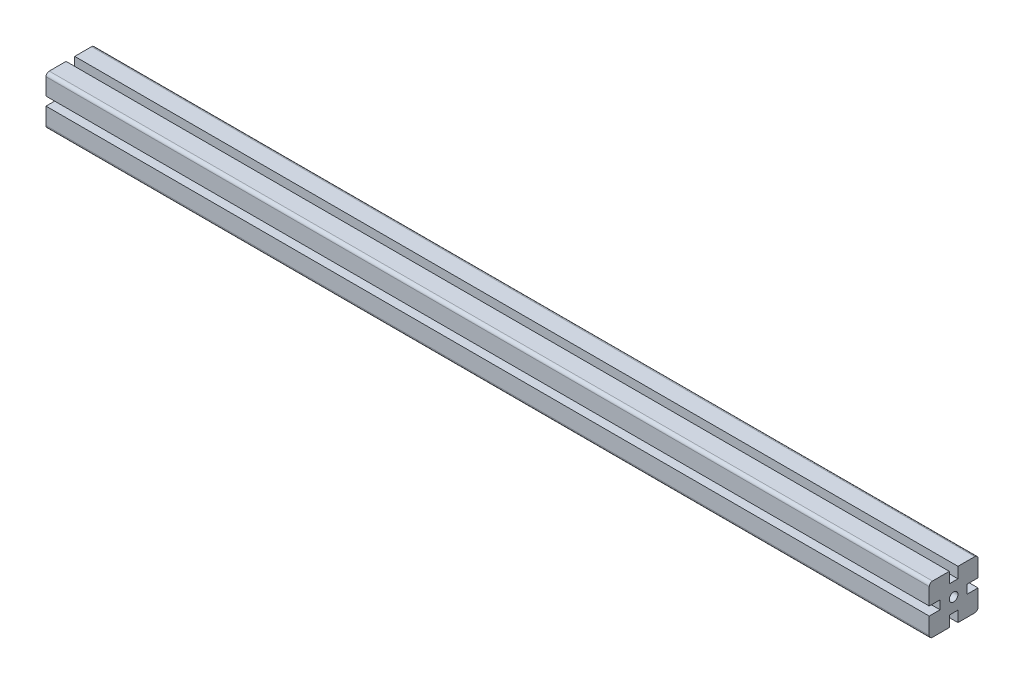
ISO-10303-21;
HEADER;
FILE_DESCRIPTION(('STEP AP214'),'2;1');
FILE_NAME('part.step','',(''),(''),'','','');
FILE_SCHEMA(('AUTOMOTIVE_DESIGN { 1 0 10303 214 1 1 1 1 }'));
ENDSEC;
DATA;
#1=APPLICATION_CONTEXT('core data for automotive mechanical design processes');
#2=APPLICATION_PROTOCOL_DEFINITION('international standard','automotive_design',2000,#1);
#3=PRODUCT_CONTEXT('',#1,'mechanical');
#4=PRODUCT('Part','Part','',(#3));
#5=PRODUCT_RELATED_PRODUCT_CATEGORY('part','',(#4));
#6=PRODUCT_DEFINITION_FORMATION('','',#4);
#7=PRODUCT_DEFINITION_CONTEXT('part definition',#1,'design');
#8=PRODUCT_DEFINITION('design','',#6,#7);
#9=PRODUCT_DEFINITION_SHAPE('','',#8);
#10=(LENGTH_UNIT() NAMED_UNIT(*) SI_UNIT(.MILLI.,.METRE.));
#11=(NAMED_UNIT(*) PLANE_ANGLE_UNIT() SI_UNIT($,.RADIAN.));
#12=(NAMED_UNIT(*) SI_UNIT($,.STERADIAN.) SOLID_ANGLE_UNIT());
#13=UNCERTAINTY_MEASURE_WITH_UNIT(LENGTH_MEASURE(1.E-05),#10,'distance_accuracy_value','');
#14=(GEOMETRIC_REPRESENTATION_CONTEXT(3) GLOBAL_UNCERTAINTY_ASSIGNED_CONTEXT((#13)) GLOBAL_UNIT_ASSIGNED_CONTEXT((#10,
#11,#12)) REPRESENTATION_CONTEXT('',''));
#15=CARTESIAN_POINT('',(0.,0.,0.));
#16=DIRECTION('',(0.,0.,1.));
#17=DIRECTION('',(1.,0.,0.));
#18=AXIS2_PLACEMENT_3D('',#15,#16,#17);
#19=CARTESIAN_POINT('',(185.,-22.5,-22.5));
#20=DIRECTION('',(0.,0.,-1.));
#21=DIRECTION('',(0.,1.,0.));
#22=AXIS2_PLACEMENT_3D('',#19,#20,#21);
#23=PLANE('',#22);
#24=DIRECTION('',(0.,1.,0.));
#25=VECTOR('',#24,1.);
#26=CARTESIAN_POINT('',(1000.,-22.5,-22.5));
#27=LINE('',#26,#25);
#28=CARTESIAN_POINT('',(1000.,-19.5,-22.5));
#29=VERTEX_POINT('',#28);
#30=CARTESIAN_POINT('',(1000.,-4.,-22.5));
#31=VERTEX_POINT('',#30);
#32=EDGE_CURVE('E271',#29,#31,#27,.T.);
#33=ORIENTED_EDGE('',*,*,#32,.F.);
#34=DIRECTION('',(1.,0.,0.));
#35=VECTOR('',#34,1.);
#36=CARTESIAN_POINT('',(185.,-19.5,-22.5));
#37=LINE('',#36,#35);
#38=CARTESIAN_POINT('',(185.,-19.5,-22.5));
#39=VERTEX_POINT('',#38);
#40=EDGE_CURVE('E202',#29,#39,#37,.F.);
#41=ORIENTED_EDGE('',*,*,#40,.T.);
#42=DIRECTION('',(0.,1.,0.));
#43=VECTOR('',#42,1.);
#44=CARTESIAN_POINT('',(185.,-22.5,-22.5));
#45=LINE('',#44,#43);
#46=CARTESIAN_POINT('',(185.,-4.,-22.5));
#47=VERTEX_POINT('',#46);
#48=EDGE_CURVE('E196',#39,#47,#45,.T.);
#49=ORIENTED_EDGE('',*,*,#48,.T.);
#50=DIRECTION('',(1.,0.,0.));
#51=VECTOR('',#50,1.);
#52=CARTESIAN_POINT('',(185.,-4.,-22.5));
#53=LINE('',#52,#51);
#54=EDGE_CURVE('E199',#47,#31,#53,.T.);
#55=ORIENTED_EDGE('',*,*,#54,.T.);
#56=EDGE_LOOP('',(#33,#41,#49,#55));
#57=FACE_BOUND('',#56,.T.);
#58=ADVANCED_FACE('F34',(#57),#23,.T.);
#59=CARTESIAN_POINT('',(185.,-22.5,-4.));
#60=DIRECTION('',(0.,-1.,0.));
#61=DIRECTION('',(0.,0.,-1.));
#62=AXIS2_PLACEMENT_3D('',#59,#60,#61);
#63=PLANE('',#62);
#64=DIRECTION('',(0.,0.,-1.));
#65=VECTOR('',#64,1.);
#66=CARTESIAN_POINT('',(185.,-22.5,-4.));
#67=LINE('',#66,#65);
#68=CARTESIAN_POINT('',(185.,-22.5,-4.));
#69=VERTEX_POINT('',#68);
#70=CARTESIAN_POINT('',(185.,-22.5,-19.5));
#71=VERTEX_POINT('',#70);
#72=EDGE_CURVE('E214',#69,#71,#67,.T.);
#73=ORIENTED_EDGE('',*,*,#72,.T.);
#74=DIRECTION('',(1.,0.,0.));
#75=VECTOR('',#74,1.);
#76=CARTESIAN_POINT('',(185.,-22.5,-19.5));
#77=LINE('',#76,#75);
#78=CARTESIAN_POINT('',(1000.,-22.5,-19.5));
#79=VERTEX_POINT('',#78);
#80=EDGE_CURVE('E327',#71,#79,#77,.T.);
#81=ORIENTED_EDGE('',*,*,#80,.T.);
#82=DIRECTION('',(0.,0.,-1.));
#83=VECTOR('',#82,1.);
#84=CARTESIAN_POINT('',(1000.,-22.5,-4.));
#85=LINE('',#84,#83);
#86=CARTESIAN_POINT('',(1000.,-22.5,-4.));
#87=VERTEX_POINT('',#86);
#88=EDGE_CURVE('E206',#87,#79,#85,.T.);
#89=ORIENTED_EDGE('',*,*,#88,.F.);
#90=DIRECTION('',(1.,0.,0.));
#91=VECTOR('',#90,1.);
#92=CARTESIAN_POINT('',(185.,-22.5,-4.));
#93=LINE('',#92,#91);
#94=EDGE_CURVE('E325',#69,#87,#93,.T.);
#95=ORIENTED_EDGE('',*,*,#94,.F.);
#96=EDGE_LOOP('',(#73,#81,#89,#95));
#97=FACE_BOUND('',#96,.T.);
#98=ADVANCED_FACE('F447',(#97),#63,.T.);
#99=CARTESIAN_POINT('',(185.,-12.5,-4.));
#100=DIRECTION('',(0.,0.,1.));
#101=DIRECTION('',(1.,0.,0.));
#102=AXIS2_PLACEMENT_3D('',#99,#100,#101);
#103=PLANE('',#102);
#104=DIRECTION('',(0.,-1.,0.));
#105=VECTOR('',#104,1.);
#106=CARTESIAN_POINT('',(1000.,-12.5,-4.));
#107=LINE('',#106,#105);
#108=CARTESIAN_POINT('',(1000.,-12.5,-4.));
#109=VERTEX_POINT('',#108);
#110=EDGE_CURVE('E320',#109,#87,#107,.T.);
#111=ORIENTED_EDGE('',*,*,#110,.F.);
#112=DIRECTION('',(1.,0.,0.));
#113=VECTOR('',#112,1.);
#114=CARTESIAN_POINT('',(185.,-12.5,-4.));
#115=LINE('',#114,#113);
#116=CARTESIAN_POINT('',(185.,-12.5,-4.));
#117=VERTEX_POINT('',#116);
#118=EDGE_CURVE('E328',#117,#109,#115,.T.);
#119=ORIENTED_EDGE('',*,*,#118,.F.);
#120=DIRECTION('',(0.,-1.,0.));
#121=VECTOR('',#120,1.);
#122=CARTESIAN_POINT('',(185.,-12.5,-4.));
#123=LINE('',#122,#121);
#124=EDGE_CURVE('E266',#117,#69,#123,.T.);
#125=ORIENTED_EDGE('',*,*,#124,.T.);
#126=ORIENTED_EDGE('',*,*,#94,.T.);
#127=EDGE_LOOP('',(#111,#119,#125,#126));
#128=FACE_BOUND('',#127,.T.);
#129=ADVANCED_FACE('F444',(#128),#103,.T.);
#130=CARTESIAN_POINT('',(185.,-12.5,4.));
#131=DIRECTION('',(0.,-1.,0.));
#132=DIRECTION('',(0.,0.,-1.));
#133=AXIS2_PLACEMENT_3D('',#130,#131,#132);
#134=PLANE('',#133);
#135=DIRECTION('',(0.,0.,-1.));
#136=VECTOR('',#135,1.);
#137=CARTESIAN_POINT('',(1000.,-12.5,4.));
#138=LINE('',#137,#136);
#139=CARTESIAN_POINT('',(1000.,-12.5,4.));
#140=VERTEX_POINT('',#139);
#141=EDGE_CURVE('E317',#140,#109,#138,.T.);
#142=ORIENTED_EDGE('',*,*,#141,.F.);
#143=DIRECTION('',(1.,0.,0.));
#144=VECTOR('',#143,1.);
#145=CARTESIAN_POINT('',(185.,-12.5,4.));
#146=LINE('',#145,#144);
#147=CARTESIAN_POINT('',(185.,-12.5,4.));
#148=VERTEX_POINT('',#147);
#149=EDGE_CURVE('E330',#148,#140,#146,.T.);
#150=ORIENTED_EDGE('',*,*,#149,.F.);
#151=DIRECTION('',(0.,0.,-1.));
#152=VECTOR('',#151,1.);
#153=CARTESIAN_POINT('',(185.,-12.5,4.));
#154=LINE('',#153,#152);
#155=EDGE_CURVE('E263',#148,#117,#154,.T.);
#156=ORIENTED_EDGE('',*,*,#155,.T.);
#157=ORIENTED_EDGE('',*,*,#118,.T.);
#158=EDGE_LOOP('',(#142,#150,#156,#157));
#159=FACE_BOUND('',#158,.T.);
#160=ADVANCED_FACE('F442',(#159),#134,.T.);
#161=CARTESIAN_POINT('',(185.,-22.5,4.));
#162=DIRECTION('',(0.,0.,-1.));
#163=DIRECTION('',(-1.,0.,0.));
#164=AXIS2_PLACEMENT_3D('',#161,#162,#163);
#165=PLANE('',#164);
#166=DIRECTION('',(0.,1.,0.));
#167=VECTOR('',#166,1.);
#168=CARTESIAN_POINT('',(1000.,-22.5,4.));
#169=LINE('',#168,#167);
#170=CARTESIAN_POINT('',(1000.,-22.5,4.));
#171=VERTEX_POINT('',#170);
#172=EDGE_CURVE('E314',#171,#140,#169,.T.);
#173=ORIENTED_EDGE('',*,*,#172,.F.);
#174=DIRECTION('',(1.,0.,0.));
#175=VECTOR('',#174,1.);
#176=CARTESIAN_POINT('',(185.,-22.5,4.));
#177=LINE('',#176,#175);
#178=CARTESIAN_POINT('',(185.,-22.5,4.));
#179=VERTEX_POINT('',#178);
#180=EDGE_CURVE('E332',#179,#171,#177,.T.);
#181=ORIENTED_EDGE('',*,*,#180,.F.);
#182=DIRECTION('',(0.,1.,0.));
#183=VECTOR('',#182,1.);
#184=CARTESIAN_POINT('',(185.,-22.5,4.));
#185=LINE('',#184,#183);
#186=EDGE_CURVE('E260',#179,#148,#185,.T.);
#187=ORIENTED_EDGE('',*,*,#186,.T.);
#188=ORIENTED_EDGE('',*,*,#149,.T.);
#189=EDGE_LOOP('',(#173,#181,#187,#188));
#190=FACE_BOUND('',#189,.T.);
#191=ADVANCED_FACE('F437',(#190),#165,.T.);
#192=CARTESIAN_POINT('',(185.,-22.5,22.5));
#193=DIRECTION('',(0.,-1.,0.));
#194=DIRECTION('',(0.,0.,-1.));
#195=AXIS2_PLACEMENT_3D('',#192,#193,#194);
#196=PLANE('',#195);
#197=DIRECTION('',(0.,0.,-1.));
#198=VECTOR('',#197,1.);
#199=CARTESIAN_POINT('',(1000.,-22.5,22.5));
#200=LINE('',#199,#198);
#201=CARTESIAN_POINT('',(1000.,-22.5,19.5));
#202=VERTEX_POINT('',#201);
#203=EDGE_CURVE('E312',#202,#171,#200,.T.);
#204=ORIENTED_EDGE('',*,*,#203,.F.);
#205=DIRECTION('',(1.,0.,0.));
#206=VECTOR('',#205,1.);
#207=CARTESIAN_POINT('',(185.,-22.5,19.5));
#208=LINE('',#207,#206);
#209=CARTESIAN_POINT('',(185.,-22.5,19.5));
#210=VERTEX_POINT('',#209);
#211=EDGE_CURVE('E383',#202,#210,#208,.F.);
#212=ORIENTED_EDGE('',*,*,#211,.T.);
#213=DIRECTION('',(0.,0.,-1.));
#214=VECTOR('',#213,1.);
#215=CARTESIAN_POINT('',(185.,-22.5,22.5));
#216=LINE('',#215,#214);
#217=EDGE_CURVE('E258',#210,#179,#216,.T.);
#218=ORIENTED_EDGE('',*,*,#217,.T.);
#219=ORIENTED_EDGE('',*,*,#180,.T.);
#220=EDGE_LOOP('',(#204,#212,#218,#219));
#221=FACE_BOUND('',#220,.T.);
#222=ADVANCED_FACE('F430',(#221),#196,.T.);
#223=CARTESIAN_POINT('',(185.,-4.,22.5));
#224=DIRECTION('',(0.,0.,1.));
#225=DIRECTION('',(0.,-1.,0.));
#226=AXIS2_PLACEMENT_3D('',#223,#224,#225);
#227=PLANE('',#226);
#228=DIRECTION('',(0.,-1.,0.));
#229=VECTOR('',#228,1.);
#230=CARTESIAN_POINT('',(185.,-4.,22.5));
#231=LINE('',#230,#229);
#232=CARTESIAN_POINT('',(185.,-4.,22.5));
#233=VERTEX_POINT('',#232);
#234=CARTESIAN_POINT('',(185.,-19.5,22.5));
#235=VERTEX_POINT('',#234);
#236=EDGE_CURVE('E255',#233,#235,#231,.T.);
#237=ORIENTED_EDGE('',*,*,#236,.T.);
#238=DIRECTION('',(1.,0.,0.));
#239=VECTOR('',#238,1.);
#240=CARTESIAN_POINT('',(185.,-19.5,22.5));
#241=LINE('',#240,#239);
#242=CARTESIAN_POINT('',(1000.,-19.5,22.5));
#243=VERTEX_POINT('',#242);
#244=EDGE_CURVE('E380',#235,#243,#241,.T.);
#245=ORIENTED_EDGE('',*,*,#244,.T.);
#246=DIRECTION('',(0.,-1.,0.));
#247=VECTOR('',#246,1.);
#248=CARTESIAN_POINT('',(1000.,-4.,22.5));
#249=LINE('',#248,#247);
#250=CARTESIAN_POINT('',(1000.,-4.,22.5));
#251=VERTEX_POINT('',#250);
#252=EDGE_CURVE('E309',#251,#243,#249,.T.);
#253=ORIENTED_EDGE('',*,*,#252,.F.);
#254=DIRECTION('',(1.,0.,0.));
#255=VECTOR('',#254,1.);
#256=CARTESIAN_POINT('',(185.,-4.,22.5));
#257=LINE('',#256,#255);
#258=EDGE_CURVE('E335',#233,#251,#257,.T.);
#259=ORIENTED_EDGE('',*,*,#258,.F.);
#260=EDGE_LOOP('',(#237,#245,#253,#259));
#261=FACE_BOUND('',#260,.T.);
#262=ADVANCED_FACE('F421',(#261),#227,.T.);
#263=CARTESIAN_POINT('',(185.,-4.,12.5));
#264=DIRECTION('',(0.,1.,0.));
#265=DIRECTION('',(0.,0.,1.));
#266=AXIS2_PLACEMENT_3D('',#263,#264,#265);
#267=PLANE('',#266);
#268=DIRECTION('',(0.,0.,1.));
#269=VECTOR('',#268,1.);
#270=CARTESIAN_POINT('',(1000.,-4.,12.5));
#271=LINE('',#270,#269);
#272=CARTESIAN_POINT('',(1000.,-4.,12.5));
#273=VERTEX_POINT('',#272);
#274=EDGE_CURVE('E306',#273,#251,#271,.T.);
#275=ORIENTED_EDGE('',*,*,#274,.F.);
#276=DIRECTION('',(1.,0.,0.));
#277=VECTOR('',#276,1.);
#278=CARTESIAN_POINT('',(185.,-4.,12.5));
#279=LINE('',#278,#277);
#280=CARTESIAN_POINT('',(185.,-4.,12.5));
#281=VERTEX_POINT('',#280);
#282=EDGE_CURVE('E337',#281,#273,#279,.T.);
#283=ORIENTED_EDGE('',*,*,#282,.F.);
#284=DIRECTION('',(0.,0.,1.));
#285=VECTOR('',#284,1.);
#286=CARTESIAN_POINT('',(185.,-4.,12.5));
#287=LINE('',#286,#285);
#288=EDGE_CURVE('E252',#281,#233,#287,.T.);
#289=ORIENTED_EDGE('',*,*,#288,.T.);
#290=ORIENTED_EDGE('',*,*,#258,.T.);
#291=EDGE_LOOP('',(#275,#283,#289,#290));
#292=FACE_BOUND('',#291,.T.);
#293=ADVANCED_FACE('F417',(#292),#267,.T.);
#294=CARTESIAN_POINT('',(185.,4.,12.5));
#295=DIRECTION('',(0.,0.,1.));
#296=DIRECTION('',(1.,0.,0.));
#297=AXIS2_PLACEMENT_3D('',#294,#295,#296);
#298=PLANE('',#297);
#299=DIRECTION('',(0.,-1.,0.));
#300=VECTOR('',#299,1.);
#301=CARTESIAN_POINT('',(1000.,4.,12.5));
#302=LINE('',#301,#300);
#303=CARTESIAN_POINT('',(1000.,4.,12.5));
#304=VERTEX_POINT('',#303);
#305=EDGE_CURVE('E303',#304,#273,#302,.T.);
#306=ORIENTED_EDGE('',*,*,#305,.F.);
#307=DIRECTION('',(1.,0.,0.));
#308=VECTOR('',#307,1.);
#309=CARTESIAN_POINT('',(185.,4.,12.5));
#310=LINE('',#309,#308);
#311=CARTESIAN_POINT('',(185.,4.,12.5));
#312=VERTEX_POINT('',#311);
#313=EDGE_CURVE('E339',#312,#304,#310,.T.);
#314=ORIENTED_EDGE('',*,*,#313,.F.);
#315=DIRECTION('',(0.,-1.,0.));
#316=VECTOR('',#315,1.);
#317=CARTESIAN_POINT('',(185.,4.,12.5));
#318=LINE('',#317,#316);
#319=EDGE_CURVE('E249',#312,#281,#318,.T.);
#320=ORIENTED_EDGE('',*,*,#319,.T.);
#321=ORIENTED_EDGE('',*,*,#282,.T.);
#322=EDGE_LOOP('',(#306,#314,#320,#321));
#323=FACE_BOUND('',#322,.T.);
#324=ADVANCED_FACE('F413',(#323),#298,.T.);
#325=CARTESIAN_POINT('',(185.,4.,22.5));
#326=DIRECTION('',(0.,-1.,0.));
#327=DIRECTION('',(0.,0.,-1.));
#328=AXIS2_PLACEMENT_3D('',#325,#326,#327);
#329=PLANE('',#328);
#330=DIRECTION('',(0.,0.,-1.));
#331=VECTOR('',#330,1.);
#332=CARTESIAN_POINT('',(1000.,4.,22.5));
#333=LINE('',#332,#331);
#334=CARTESIAN_POINT('',(1000.,4.,22.5));
#335=VERTEX_POINT('',#334);
#336=EDGE_CURVE('E300',#335,#304,#333,.T.);
#337=ORIENTED_EDGE('',*,*,#336,.F.);
#338=DIRECTION('',(1.,0.,0.));
#339=VECTOR('',#338,1.);
#340=CARTESIAN_POINT('',(185.,4.,22.5));
#341=LINE('',#340,#339);
#342=CARTESIAN_POINT('',(185.,4.,22.5));
#343=VERTEX_POINT('',#342);
#344=EDGE_CURVE('E341',#343,#335,#341,.T.);
#345=ORIENTED_EDGE('',*,*,#344,.F.);
#346=DIRECTION('',(0.,0.,-1.));
#347=VECTOR('',#346,1.);
#348=CARTESIAN_POINT('',(185.,4.,22.5));
#349=LINE('',#348,#347);
#350=EDGE_CURVE('E246',#343,#312,#349,.T.);
#351=ORIENTED_EDGE('',*,*,#350,.T.);
#352=ORIENTED_EDGE('',*,*,#313,.T.);
#353=EDGE_LOOP('',(#337,#345,#351,#352));
#354=FACE_BOUND('',#353,.T.);
#355=ADVANCED_FACE('F410',(#354),#329,.T.);
#356=CARTESIAN_POINT('',(185.,22.5,22.5));
#357=DIRECTION('',(0.,0.,1.));
#358=DIRECTION('',(0.,-1.,0.));
#359=AXIS2_PLACEMENT_3D('',#356,#357,#358);
#360=PLANE('',#359);
#361=DIRECTION('',(0.,-1.,0.));
#362=VECTOR('',#361,1.);
#363=CARTESIAN_POINT('',(1000.,22.5,22.5));
#364=LINE('',#363,#362);
#365=CARTESIAN_POINT('',(1000.,19.5,22.5));
#366=VERTEX_POINT('',#365);
#367=EDGE_CURVE('E298',#366,#335,#364,.T.);
#368=ORIENTED_EDGE('',*,*,#367,.F.);
#369=DIRECTION('',(1.,0.,0.));
#370=VECTOR('',#369,1.);
#371=CARTESIAN_POINT('',(185.,19.5,22.5));
#372=LINE('',#371,#370);
#373=CARTESIAN_POINT('',(185.,19.5,22.5));
#374=VERTEX_POINT('',#373);
#375=EDGE_CURVE('E11',#366,#374,#372,.F.);
#376=ORIENTED_EDGE('',*,*,#375,.T.);
#377=DIRECTION('',(0.,-1.,0.));
#378=VECTOR('',#377,1.);
#379=CARTESIAN_POINT('',(185.,22.5,22.5));
#380=LINE('',#379,#378);
#381=EDGE_CURVE('E244',#374,#343,#380,.T.);
#382=ORIENTED_EDGE('',*,*,#381,.T.);
#383=ORIENTED_EDGE('',*,*,#344,.T.);
#384=EDGE_LOOP('',(#368,#376,#382,#383));
#385=FACE_BOUND('',#384,.T.);
#386=ADVANCED_FACE('F405',(#385),#360,.T.);
#387=CARTESIAN_POINT('',(185.,22.5,4.));
#388=DIRECTION('',(0.,1.,0.));
#389=DIRECTION('',(0.,0.,1.));
#390=AXIS2_PLACEMENT_3D('',#387,#388,#389);
#391=PLANE('',#390);
#392=DIRECTION('',(0.,0.,1.));
#393=VECTOR('',#392,1.);
#394=CARTESIAN_POINT('',(185.,22.5,4.));
#395=LINE('',#394,#393);
#396=CARTESIAN_POINT('',(185.,22.5,4.));
#397=VERTEX_POINT('',#396);
#398=CARTESIAN_POINT('',(185.,22.5,19.5));
#399=VERTEX_POINT('',#398);
#400=EDGE_CURVE('E241',#397,#399,#395,.T.);
#401=ORIENTED_EDGE('',*,*,#400,.T.);
#402=DIRECTION('',(1.,0.,0.));
#403=VECTOR('',#402,1.);
#404=CARTESIAN_POINT('',(185.,22.5,19.5));
#405=LINE('',#404,#403);
#406=CARTESIAN_POINT('',(1000.,22.5,19.5));
#407=VERTEX_POINT('',#406);
#408=EDGE_CURVE('E42',#399,#407,#405,.T.);
#409=ORIENTED_EDGE('',*,*,#408,.T.);
#410=DIRECTION('',(0.,0.,1.));
#411=VECTOR('',#410,1.);
#412=CARTESIAN_POINT('',(1000.,22.5,4.));
#413=LINE('',#412,#411);
#414=CARTESIAN_POINT('',(1000.,22.5,4.));
#415=VERTEX_POINT('',#414);
#416=EDGE_CURVE('E295',#415,#407,#413,.T.);
#417=ORIENTED_EDGE('',*,*,#416,.F.);
#418=DIRECTION('',(1.,0.,0.));
#419=VECTOR('',#418,1.);
#420=CARTESIAN_POINT('',(185.,22.5,4.));
#421=LINE('',#420,#419);
#422=EDGE_CURVE('E344',#397,#415,#421,.T.);
#423=ORIENTED_EDGE('',*,*,#422,.F.);
#424=EDGE_LOOP('',(#401,#409,#417,#423));
#425=FACE_BOUND('',#424,.T.);
#426=ADVANCED_FACE('F388',(#425),#391,.T.);
#427=CARTESIAN_POINT('',(185.,12.5,4.));
#428=DIRECTION('',(0.,0.,-1.));
#429=DIRECTION('',(-1.,0.,0.));
#430=AXIS2_PLACEMENT_3D('',#427,#428,#429);
#431=PLANE('',#430);
#432=DIRECTION('',(0.,1.,0.));
#433=VECTOR('',#432,1.);
#434=CARTESIAN_POINT('',(1000.,12.5,4.));
#435=LINE('',#434,#433);
#436=CARTESIAN_POINT('',(1000.,12.5,4.));
#437=VERTEX_POINT('',#436);
#438=EDGE_CURVE('E292',#437,#415,#435,.T.);
#439=ORIENTED_EDGE('',*,*,#438,.F.);
#440=DIRECTION('',(1.,0.,0.));
#441=VECTOR('',#440,1.);
#442=CARTESIAN_POINT('',(185.,12.5,4.));
#443=LINE('',#442,#441);
#444=CARTESIAN_POINT('',(185.,12.5,4.));
#445=VERTEX_POINT('',#444);
#446=EDGE_CURVE('E346',#445,#437,#443,.T.);
#447=ORIENTED_EDGE('',*,*,#446,.F.);
#448=DIRECTION('',(0.,1.,0.));
#449=VECTOR('',#448,1.);
#450=CARTESIAN_POINT('',(185.,12.5,4.));
#451=LINE('',#450,#449);
#452=EDGE_CURVE('E238',#445,#397,#451,.T.);
#453=ORIENTED_EDGE('',*,*,#452,.T.);
#454=ORIENTED_EDGE('',*,*,#422,.T.);
#455=EDGE_LOOP('',(#439,#447,#453,#454));
#456=FACE_BOUND('',#455,.T.);
#457=ADVANCED_FACE('F398',(#456),#431,.T.);
#458=CARTESIAN_POINT('',(185.,12.5,-4.));
#459=DIRECTION('',(0.,1.,0.));
#460=DIRECTION('',(0.,0.,1.));
#461=AXIS2_PLACEMENT_3D('',#458,#459,#460);
#462=PLANE('',#461);
#463=DIRECTION('',(0.,0.,1.));
#464=VECTOR('',#463,1.);
#465=CARTESIAN_POINT('',(1000.,12.5,-4.));
#466=LINE('',#465,#464);
#467=CARTESIAN_POINT('',(1000.,12.5,-4.));
#468=VERTEX_POINT('',#467);
#469=EDGE_CURVE('E289',#468,#437,#466,.T.);
#470=ORIENTED_EDGE('',*,*,#469,.F.);
#471=DIRECTION('',(1.,0.,0.));
#472=VECTOR('',#471,1.);
#473=CARTESIAN_POINT('',(185.,12.5,-4.));
#474=LINE('',#473,#472);
#475=CARTESIAN_POINT('',(185.,12.5,-4.));
#476=VERTEX_POINT('',#475);
#477=EDGE_CURVE('E348',#476,#468,#474,.T.);
#478=ORIENTED_EDGE('',*,*,#477,.F.);
#479=DIRECTION('',(0.,0.,1.));
#480=VECTOR('',#479,1.);
#481=CARTESIAN_POINT('',(185.,12.5,-4.));
#482=LINE('',#481,#480);
#483=EDGE_CURVE('E235',#476,#445,#482,.T.);
#484=ORIENTED_EDGE('',*,*,#483,.T.);
#485=ORIENTED_EDGE('',*,*,#446,.T.);
#486=EDGE_LOOP('',(#470,#478,#484,#485));
#487=FACE_BOUND('',#486,.T.);
#488=ADVANCED_FACE('F490',(#487),#462,.T.);
#489=CARTESIAN_POINT('',(185.,22.5,-4.));
#490=DIRECTION('',(0.,0.,1.));
#491=DIRECTION('',(1.,0.,0.));
#492=AXIS2_PLACEMENT_3D('',#489,#490,#491);
#493=PLANE('',#492);
#494=DIRECTION('',(0.,-1.,0.));
#495=VECTOR('',#494,1.);
#496=CARTESIAN_POINT('',(1000.,22.5,-4.));
#497=LINE('',#496,#495);
#498=CARTESIAN_POINT('',(1000.,22.5,-4.));
#499=VERTEX_POINT('',#498);
#500=EDGE_CURVE('E286',#499,#468,#497,.T.);
#501=ORIENTED_EDGE('',*,*,#500,.F.);
#502=DIRECTION('',(1.,0.,0.));
#503=VECTOR('',#502,1.);
#504=CARTESIAN_POINT('',(185.,22.5,-4.));
#505=LINE('',#504,#503);
#506=CARTESIAN_POINT('',(185.,22.5,-4.));
#507=VERTEX_POINT('',#506);
#508=EDGE_CURVE('E350',#507,#499,#505,.T.);
#509=ORIENTED_EDGE('',*,*,#508,.F.);
#510=DIRECTION('',(0.,-1.,0.));
#511=VECTOR('',#510,1.);
#512=CARTESIAN_POINT('',(185.,22.5,-4.));
#513=LINE('',#512,#511);
#514=EDGE_CURVE('E232',#507,#476,#513,.T.);
#515=ORIENTED_EDGE('',*,*,#514,.T.);
#516=ORIENTED_EDGE('',*,*,#477,.T.);
#517=EDGE_LOOP('',(#501,#509,#515,#516));
#518=FACE_BOUND('',#517,.T.);
#519=ADVANCED_FACE('F487',(#518),#493,.T.);
#520=CARTESIAN_POINT('',(185.,22.5,-22.5));
#521=DIRECTION('',(0.,1.,0.));
#522=DIRECTION('',(0.,0.,1.));
#523=AXIS2_PLACEMENT_3D('',#520,#521,#522);
#524=PLANE('',#523);
#525=DIRECTION('',(0.,0.,1.));
#526=VECTOR('',#525,1.);
#527=CARTESIAN_POINT('',(1000.,22.5,-22.5));
#528=LINE('',#527,#526);
#529=CARTESIAN_POINT('',(1000.,22.5,-19.5));
#530=VERTEX_POINT('',#529);
#531=EDGE_CURVE('E284',#530,#499,#528,.T.);
#532=ORIENTED_EDGE('',*,*,#531,.F.);
#533=DIRECTION('',(1.,0.,0.));
#534=VECTOR('',#533,1.);
#535=CARTESIAN_POINT('',(185.,22.5,-19.5));
#536=LINE('',#535,#534);
#537=CARTESIAN_POINT('',(185.,22.5,-19.5));
#538=VERTEX_POINT('',#537);
#539=EDGE_CURVE('E57',#530,#538,#536,.F.);
#540=ORIENTED_EDGE('',*,*,#539,.T.);
#541=DIRECTION('',(0.,0.,1.));
#542=VECTOR('',#541,1.);
#543=CARTESIAN_POINT('',(185.,22.5,-22.5));
#544=LINE('',#543,#542);
#545=EDGE_CURVE('E230',#538,#507,#544,.T.);
#546=ORIENTED_EDGE('',*,*,#545,.T.);
#547=ORIENTED_EDGE('',*,*,#508,.T.);
#548=EDGE_LOOP('',(#532,#540,#546,#547));
#549=FACE_BOUND('',#548,.T.);
#550=ADVANCED_FACE('F483',(#549),#524,.T.);
#551=CARTESIAN_POINT('',(185.,4.,-22.5));
#552=DIRECTION('',(0.,0.,-1.));
#553=DIRECTION('',(0.,1.,0.));
#554=AXIS2_PLACEMENT_3D('',#551,#552,#553);
#555=PLANE('',#554);
#556=DIRECTION('',(0.,1.,0.));
#557=VECTOR('',#556,1.);
#558=CARTESIAN_POINT('',(185.,4.,-22.5));
#559=LINE('',#558,#557);
#560=CARTESIAN_POINT('',(185.,4.,-22.5));
#561=VERTEX_POINT('',#560);
#562=CARTESIAN_POINT('',(185.,19.5,-22.5));
#563=VERTEX_POINT('',#562);
#564=EDGE_CURVE('E228',#561,#563,#559,.T.);
#565=ORIENTED_EDGE('',*,*,#564,.T.);
#566=DIRECTION('',(1.,0.,0.));
#567=VECTOR('',#566,1.);
#568=CARTESIAN_POINT('',(185.,19.5,-22.5));
#569=LINE('',#568,#567);
#570=CARTESIAN_POINT('',(1000.,19.5,-22.5));
#571=VERTEX_POINT('',#570);
#572=EDGE_CURVE('E376',#563,#571,#569,.T.);
#573=ORIENTED_EDGE('',*,*,#572,.T.);
#574=DIRECTION('',(0.,1.,0.));
#575=VECTOR('',#574,1.);
#576=CARTESIAN_POINT('',(1000.,4.,-22.5));
#577=LINE('',#576,#575);
#578=CARTESIAN_POINT('',(1000.,4.,-22.5));
#579=VERTEX_POINT('',#578);
#580=EDGE_CURVE('E281',#579,#571,#577,.T.);
#581=ORIENTED_EDGE('',*,*,#580,.F.);
#582=DIRECTION('',(1.,0.,0.));
#583=VECTOR('',#582,1.);
#584=CARTESIAN_POINT('',(185.,4.,-22.5));
#585=LINE('',#584,#583);
#586=EDGE_CURVE('E353',#561,#579,#585,.T.);
#587=ORIENTED_EDGE('',*,*,#586,.F.);
#588=EDGE_LOOP('',(#565,#573,#581,#587));
#589=FACE_BOUND('',#588,.T.);
#590=ADVANCED_FACE('F479',(#589),#555,.T.);
#591=CARTESIAN_POINT('',(185.,4.,-12.5));
#592=DIRECTION('',(0.,-1.,0.));
#593=DIRECTION('',(0.,0.,-1.));
#594=AXIS2_PLACEMENT_3D('',#591,#592,#593);
#595=PLANE('',#594);
#596=DIRECTION('',(0.,0.,-1.));
#597=VECTOR('',#596,1.);
#598=CARTESIAN_POINT('',(1000.,4.,-12.5));
#599=LINE('',#598,#597);
#600=CARTESIAN_POINT('',(1000.,4.,-12.5));
#601=VERTEX_POINT('',#600);
#602=EDGE_CURVE('E278',#601,#579,#599,.T.);
#603=ORIENTED_EDGE('',*,*,#602,.F.);
#604=DIRECTION('',(1.,0.,0.));
#605=VECTOR('',#604,1.);
#606=CARTESIAN_POINT('',(185.,4.,-12.5));
#607=LINE('',#606,#605);
#608=CARTESIAN_POINT('',(185.,4.,-12.5));
#609=VERTEX_POINT('',#608);
#610=EDGE_CURVE('E355',#609,#601,#607,.T.);
#611=ORIENTED_EDGE('',*,*,#610,.F.);
#612=DIRECTION('',(0.,0.,-1.));
#613=VECTOR('',#612,1.);
#614=CARTESIAN_POINT('',(185.,4.,-12.5));
#615=LINE('',#614,#613);
#616=EDGE_CURVE('E222',#609,#561,#615,.T.);
#617=ORIENTED_EDGE('',*,*,#616,.T.);
#618=ORIENTED_EDGE('',*,*,#586,.T.);
#619=EDGE_LOOP('',(#603,#611,#617,#618));
#620=FACE_BOUND('',#619,.T.);
#621=ADVANCED_FACE('F475',(#620),#595,.T.);
#622=CARTESIAN_POINT('',(185.,-4.,-12.5));
#623=DIRECTION('',(0.,0.,-1.));
#624=DIRECTION('',(-1.,0.,0.));
#625=AXIS2_PLACEMENT_3D('',#622,#623,#624);
#626=PLANE('',#625);
#627=DIRECTION('',(0.,1.,0.));
#628=VECTOR('',#627,1.);
#629=CARTESIAN_POINT('',(1000.,-4.,-12.5));
#630=LINE('',#629,#628);
#631=CARTESIAN_POINT('',(1000.,-4.,-12.5));
#632=VERTEX_POINT('',#631);
#633=EDGE_CURVE('E275',#632,#601,#630,.T.);
#634=ORIENTED_EDGE('',*,*,#633,.F.);
#635=DIRECTION('',(1.,0.,0.));
#636=VECTOR('',#635,1.);
#637=CARTESIAN_POINT('',(185.,-4.,-12.5));
#638=LINE('',#637,#636);
#639=CARTESIAN_POINT('',(185.,-4.,-12.5));
#640=VERTEX_POINT('',#639);
#641=EDGE_CURVE('E213',#640,#632,#638,.T.);
#642=ORIENTED_EDGE('',*,*,#641,.F.);
#643=DIRECTION('',(0.,1.,0.));
#644=VECTOR('',#643,1.);
#645=CARTESIAN_POINT('',(185.,-4.,-12.5));
#646=LINE('',#645,#644);
#647=EDGE_CURVE('E220',#640,#609,#646,.T.);
#648=ORIENTED_EDGE('',*,*,#647,.T.);
#649=ORIENTED_EDGE('',*,*,#610,.T.);
#650=EDGE_LOOP('',(#634,#642,#648,#649));
#651=FACE_BOUND('',#650,.T.);
#652=ADVANCED_FACE('F472',(#651),#626,.T.);
#653=CARTESIAN_POINT('',(185.,-4.,-22.5));
#654=DIRECTION('',(0.,1.,0.));
#655=DIRECTION('',(0.,0.,1.));
#656=AXIS2_PLACEMENT_3D('',#653,#654,#655);
#657=PLANE('',#656);
#658=DIRECTION('',(0.,0.,1.));
#659=VECTOR('',#658,1.);
#660=CARTESIAN_POINT('',(1000.,-4.,-22.5));
#661=LINE('',#660,#659);
#662=EDGE_CURVE('E212',#31,#632,#661,.T.);
#663=ORIENTED_EDGE('',*,*,#662,.F.);
#664=ORIENTED_EDGE('',*,*,#54,.F.);
#665=DIRECTION('',(0.,0.,1.));
#666=VECTOR('',#665,1.);
#667=CARTESIAN_POINT('',(185.,-4.,-22.5));
#668=LINE('',#667,#666);
#669=EDGE_CURVE('E205',#47,#640,#668,.T.);
#670=ORIENTED_EDGE('',*,*,#669,.T.);
#671=ORIENTED_EDGE('',*,*,#641,.T.);
#672=EDGE_LOOP('',(#663,#664,#670,#671));
#673=FACE_BOUND('',#672,.T.);
#674=ADVANCED_FACE('F210',(#673),#657,.T.);
#675=CARTESIAN_POINT('',(185.,0.,0.));
#676=DIRECTION('',(1.,0.,0.));
#677=DIRECTION('',(0.,0.,-1.));
#678=AXIS2_PLACEMENT_3D('',#675,#676,#677);
#679=PLANE('',#678);
#680=CARTESIAN_POINT('',(185.,0.,0.));
#681=DIRECTION('',(1.,0.,0.));
#682=DIRECTION('',(0.,0.,1.));
#683=AXIS2_PLACEMENT_3D('',#680,#681,#682);
#684=CIRCLE('',#683,4.);
#685=CARTESIAN_POINT('',(185.,0.,4.));
#686=VERTEX_POINT('',#685);
#687=EDGE_CURVE('E273',#686,#686,#684,.T.);
#688=ORIENTED_EDGE('',*,*,#687,.T.);
#689=EDGE_LOOP('',(#688));
#690=FACE_BOUND('',#689,.T.);
#691=ORIENTED_EDGE('',*,*,#48,.F.);
#692=CARTESIAN_POINT('',(185.,-19.5,-19.5));
#693=DIRECTION('',(1.,0.,0.));
#694=DIRECTION('',(0.,0.,-1.));
#695=AXIS2_PLACEMENT_3D('',#692,#693,#694);
#696=CIRCLE('',#695,3.);
#697=EDGE_CURVE('E374',#39,#71,#696,.F.);
#698=ORIENTED_EDGE('',*,*,#697,.T.);
#699=ORIENTED_EDGE('',*,*,#72,.F.);
#700=ORIENTED_EDGE('',*,*,#124,.F.);
#701=ORIENTED_EDGE('',*,*,#155,.F.);
#702=ORIENTED_EDGE('',*,*,#186,.F.);
#703=ORIENTED_EDGE('',*,*,#217,.F.);
#704=CARTESIAN_POINT('',(185.,-19.5,19.5));
#705=DIRECTION('',(1.,0.,0.));
#706=DIRECTION('',(0.,0.,-1.));
#707=AXIS2_PLACEMENT_3D('',#704,#705,#706);
#708=CIRCLE('',#707,3.);
#709=EDGE_CURVE('E371',#210,#235,#708,.F.);
#710=ORIENTED_EDGE('',*,*,#709,.T.);
#711=ORIENTED_EDGE('',*,*,#236,.F.);
#712=ORIENTED_EDGE('',*,*,#288,.F.);
#713=ORIENTED_EDGE('',*,*,#319,.F.);
#714=ORIENTED_EDGE('',*,*,#350,.F.);
#715=ORIENTED_EDGE('',*,*,#381,.F.);
#716=CARTESIAN_POINT('',(185.,19.5,19.5));
#717=DIRECTION('',(1.,0.,0.));
#718=DIRECTION('',(0.,0.,-1.));
#719=AXIS2_PLACEMENT_3D('',#716,#717,#718);
#720=CIRCLE('',#719,3.);
#721=EDGE_CURVE('E369',#374,#399,#720,.F.);
#722=ORIENTED_EDGE('',*,*,#721,.T.);
#723=ORIENTED_EDGE('',*,*,#400,.F.);
#724=ORIENTED_EDGE('',*,*,#452,.F.);
#725=ORIENTED_EDGE('',*,*,#483,.F.);
#726=ORIENTED_EDGE('',*,*,#514,.F.);
#727=ORIENTED_EDGE('',*,*,#545,.F.);
#728=CARTESIAN_POINT('',(185.,19.5,-19.5));
#729=DIRECTION('',(1.,0.,0.));
#730=DIRECTION('',(0.,0.,-1.));
#731=AXIS2_PLACEMENT_3D('',#728,#729,#730);
#732=CIRCLE('',#731,3.);
#733=EDGE_CURVE('E49',#538,#563,#732,.F.);
#734=ORIENTED_EDGE('',*,*,#733,.T.);
#735=ORIENTED_EDGE('',*,*,#564,.F.);
#736=ORIENTED_EDGE('',*,*,#616,.F.);
#737=ORIENTED_EDGE('',*,*,#647,.F.);
#738=ORIENTED_EDGE('',*,*,#669,.F.);
#739=EDGE_LOOP('',(#691,#698,#699,#700,#701,#702,#703,#710,#711,#712,#713,#714,#715,#722,#723,
#724,#725,#726,#727,#734,#735,#736,#737,#738));
#740=FACE_BOUND('',#739,.T.);
#741=ADVANCED_FACE('F217',(#690,#740),#679,.F.);
#742=CARTESIAN_POINT('',(1000.,0.,0.));
#743=DIRECTION('',(1.,0.,0.));
#744=DIRECTION('',(0.,0.,-1.));
#745=AXIS2_PLACEMENT_3D('',#742,#743,#744);
#746=PLANE('',#745);
#747=CARTESIAN_POINT('',(1000.,0.,0.));
#748=DIRECTION('',(1.,0.,0.));
#749=DIRECTION('',(0.,0.,1.));
#750=AXIS2_PLACEMENT_3D('',#747,#748,#749);
#751=CIRCLE('',#750,4.);
#752=CARTESIAN_POINT('',(1000.,0.,4.));
#753=VERTEX_POINT('',#752);
#754=EDGE_CURVE('E526',#753,#753,#751,.T.);
#755=ORIENTED_EDGE('',*,*,#754,.F.);
#756=EDGE_LOOP('',(#755));
#757=FACE_BOUND('',#756,.T.);
#758=ORIENTED_EDGE('',*,*,#88,.T.);
#759=CARTESIAN_POINT('',(1000.,-19.5,-19.5));
#760=DIRECTION('',(1.,0.,0.));
#761=DIRECTION('',(0.,0.,-1.));
#762=AXIS2_PLACEMENT_3D('',#759,#760,#761);
#763=CIRCLE('',#762,3.);
#764=EDGE_CURVE('E366',#79,#29,#763,.T.);
#765=ORIENTED_EDGE('',*,*,#764,.T.);
#766=ORIENTED_EDGE('',*,*,#32,.T.);
#767=ORIENTED_EDGE('',*,*,#662,.T.);
#768=ORIENTED_EDGE('',*,*,#633,.T.);
#769=ORIENTED_EDGE('',*,*,#602,.T.);
#770=ORIENTED_EDGE('',*,*,#580,.T.);
#771=CARTESIAN_POINT('',(1000.,19.5,-19.5));
#772=DIRECTION('',(1.,0.,0.));
#773=DIRECTION('',(0.,0.,-1.));
#774=AXIS2_PLACEMENT_3D('',#771,#772,#773);
#775=CIRCLE('',#774,3.);
#776=EDGE_CURVE('E364',#571,#530,#775,.T.);
#777=ORIENTED_EDGE('',*,*,#776,.T.);
#778=ORIENTED_EDGE('',*,*,#531,.T.);
#779=ORIENTED_EDGE('',*,*,#500,.T.);
#780=ORIENTED_EDGE('',*,*,#469,.T.);
#781=ORIENTED_EDGE('',*,*,#438,.T.);
#782=ORIENTED_EDGE('',*,*,#416,.T.);
#783=CARTESIAN_POINT('',(1000.,19.5,19.5));
#784=DIRECTION('',(1.,0.,0.));
#785=DIRECTION('',(0.,0.,-1.));
#786=AXIS2_PLACEMENT_3D('',#783,#784,#785);
#787=CIRCLE('',#786,3.);
#788=EDGE_CURVE('E360',#407,#366,#787,.T.);
#789=ORIENTED_EDGE('',*,*,#788,.T.);
#790=ORIENTED_EDGE('',*,*,#367,.T.);
#791=ORIENTED_EDGE('',*,*,#336,.T.);
#792=ORIENTED_EDGE('',*,*,#305,.T.);
#793=ORIENTED_EDGE('',*,*,#274,.T.);
#794=ORIENTED_EDGE('',*,*,#252,.T.);
#795=CARTESIAN_POINT('',(1000.,-19.5,19.5));
#796=DIRECTION('',(1.,0.,0.));
#797=DIRECTION('',(0.,0.,-1.));
#798=AXIS2_PLACEMENT_3D('',#795,#796,#797);
#799=CIRCLE('',#798,3.);
#800=EDGE_CURVE('E362',#243,#202,#799,.T.);
#801=ORIENTED_EDGE('',*,*,#800,.T.);
#802=ORIENTED_EDGE('',*,*,#203,.T.);
#803=ORIENTED_EDGE('',*,*,#172,.T.);
#804=ORIENTED_EDGE('',*,*,#141,.T.);
#805=ORIENTED_EDGE('',*,*,#110,.T.);
#806=EDGE_LOOP('',(#758,#765,#766,#767,#768,#769,#770,#777,#778,#779,#780,#781,#782,#789,#790,
#791,#792,#793,#794,#801,#802,#803,#804,#805));
#807=FACE_BOUND('',#806,.T.);
#808=ADVANCED_FACE('F393',(#757,#807),#746,.T.);
#809=CARTESIAN_POINT('',(185.,0.,0.));
#810=DIRECTION('',(1.,0.,0.));
#811=DIRECTION('',(0.,0.,-1.));
#812=AXIS2_PLACEMENT_3D('',#809,#810,#811);
#813=CYLINDRICAL_SURFACE('',#812,4.);
#814=ORIENTED_EDGE('',*,*,#687,.F.);
#815=EDGE_LOOP('',(#814));
#816=FACE_BOUND('',#815,.T.);
#817=ORIENTED_EDGE('',*,*,#754,.T.);
#818=EDGE_LOOP('',(#817));
#819=FACE_BOUND('',#818,.T.);
#820=ADVANCED_FACE('F453',(#816,#819),#813,.F.);
#821=CARTESIAN_POINT('',(185.,-19.5,-19.5));
#822=DIRECTION('',(1.,0.,0.));
#823=DIRECTION('',(0.,0.,-1.));
#824=AXIS2_PLACEMENT_3D('',#821,#822,#823);
#825=CYLINDRICAL_SURFACE('',#824,3.);
#826=ORIENTED_EDGE('',*,*,#697,.F.);
#827=ORIENTED_EDGE('',*,*,#40,.F.);
#828=ORIENTED_EDGE('',*,*,#764,.F.);
#829=ORIENTED_EDGE('',*,*,#80,.F.);
#830=EDGE_LOOP('',(#826,#827,#828,#829));
#831=FACE_BOUND('',#830,.T.);
#832=ADVANCED_FACE('F450',(#831),#825,.T.);
#833=CARTESIAN_POINT('',(185.,19.5,-19.5));
#834=DIRECTION('',(1.,0.,0.));
#835=DIRECTION('',(0.,0.,-1.));
#836=AXIS2_PLACEMENT_3D('',#833,#834,#835);
#837=CYLINDRICAL_SURFACE('',#836,3.);
#838=ORIENTED_EDGE('',*,*,#733,.F.);
#839=ORIENTED_EDGE('',*,*,#539,.F.);
#840=ORIENTED_EDGE('',*,*,#776,.F.);
#841=ORIENTED_EDGE('',*,*,#572,.F.);
#842=EDGE_LOOP('',(#838,#839,#840,#841));
#843=FACE_BOUND('',#842,.T.);
#844=ADVANCED_FACE('F452',(#843),#837,.T.);
#845=CARTESIAN_POINT('',(185.,-19.5,19.5));
#846=DIRECTION('',(1.,0.,0.));
#847=DIRECTION('',(0.,0.,-1.));
#848=AXIS2_PLACEMENT_3D('',#845,#846,#847);
#849=CYLINDRICAL_SURFACE('',#848,3.);
#850=ORIENTED_EDGE('',*,*,#709,.F.);
#851=ORIENTED_EDGE('',*,*,#211,.F.);
#852=ORIENTED_EDGE('',*,*,#800,.F.);
#853=ORIENTED_EDGE('',*,*,#244,.F.);
#854=EDGE_LOOP('',(#850,#851,#852,#853));
#855=FACE_BOUND('',#854,.T.);
#856=ADVANCED_FACE('F426',(#855),#849,.T.);
#857=CARTESIAN_POINT('',(185.,19.5,19.5));
#858=DIRECTION('',(1.,0.,0.));
#859=DIRECTION('',(0.,0.,-1.));
#860=AXIS2_PLACEMENT_3D('',#857,#858,#859);
#861=CYLINDRICAL_SURFACE('',#860,3.);
#862=ORIENTED_EDGE('',*,*,#721,.F.);
#863=ORIENTED_EDGE('',*,*,#375,.F.);
#864=ORIENTED_EDGE('',*,*,#788,.F.);
#865=ORIENTED_EDGE('',*,*,#408,.F.);
#866=EDGE_LOOP('',(#862,#863,#864,#865));
#867=FACE_BOUND('',#866,.T.);
#868=ADVANCED_FACE('F36',(#867),#861,.T.);
#869=CLOSED_SHELL('',(#58,#98,#129,#160,#191,#222,#262,#293,#324,#355,#386,#426,#457,#488,#519,
#550,#590,#621,#652,#674,#741,#808,#820,#832,#844,#856,#868));
#870=MANIFOLD_SOLID_BREP('B2',#869);
#871=ADVANCED_BREP_SHAPE_REPRESENTATION('',(#18,#870),#14);
#872=SHAPE_DEFINITION_REPRESENTATION(#9,#871);
ENDSEC;
END-ISO-10303-21;
